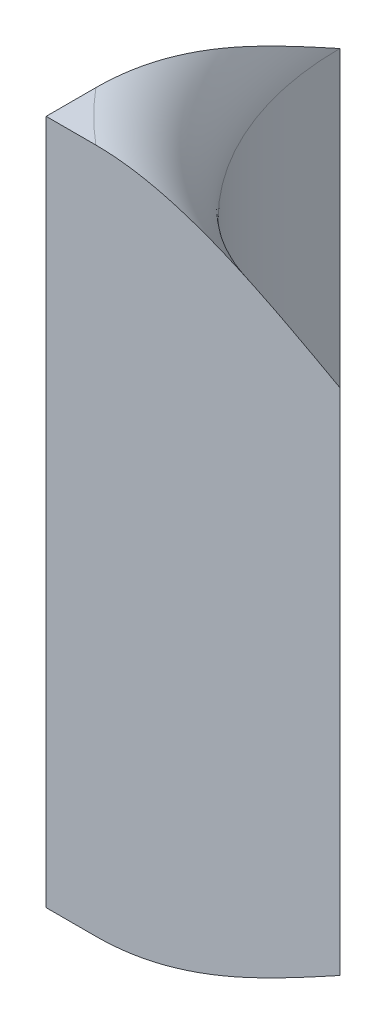
ISO-10303-21;
HEADER;
FILE_DESCRIPTION(('STEP AP214'),'2;1');
FILE_NAME('part.step','',(''),(''),'','','');
FILE_SCHEMA(('AUTOMOTIVE_DESIGN { 1 0 10303 214 1 1 1 1 }'));
ENDSEC;
DATA;
#1=APPLICATION_CONTEXT('core data for automotive mechanical design processes');
#2=APPLICATION_PROTOCOL_DEFINITION('international standard','automotive_design',2000,#1);
#3=PRODUCT_CONTEXT('',#1,'mechanical');
#4=PRODUCT('Part','Part','',(#3));
#5=PRODUCT_RELATED_PRODUCT_CATEGORY('part','',(#4));
#6=PRODUCT_DEFINITION_FORMATION('','',#4);
#7=PRODUCT_DEFINITION_CONTEXT('part definition',#1,'design');
#8=PRODUCT_DEFINITION('design','',#6,#7);
#9=PRODUCT_DEFINITION_SHAPE('','',#8);
#10=(LENGTH_UNIT() NAMED_UNIT(*) SI_UNIT(.MILLI.,.METRE.));
#11=(NAMED_UNIT(*) PLANE_ANGLE_UNIT() SI_UNIT($,.RADIAN.));
#12=(NAMED_UNIT(*) SI_UNIT($,.STERADIAN.) SOLID_ANGLE_UNIT());
#13=UNCERTAINTY_MEASURE_WITH_UNIT(LENGTH_MEASURE(1.E-05),#10,'distance_accuracy_value','');
#14=(GEOMETRIC_REPRESENTATION_CONTEXT(3) GLOBAL_UNCERTAINTY_ASSIGNED_CONTEXT((#13)) GLOBAL_UNIT_ASSIGNED_CONTEXT((#10,
#11,#12)) REPRESENTATION_CONTEXT('',''));
#15=CARTESIAN_POINT('',(0.,0.,0.));
#16=DIRECTION('',(0.,0.,1.));
#17=DIRECTION('',(1.,0.,0.));
#18=AXIS2_PLACEMENT_3D('',#15,#16,#17);
#19=CARTESIAN_POINT('',(4.3,1.06,-7.3));
#20=DIRECTION('',(0.,1.,0.));
#21=DIRECTION('',(0.,0.,1.));
#22=AXIS2_PLACEMENT_3D('',#19,#20,#21);
#23=TOROIDAL_SURFACE('',#22,0.389999999999999,0.09);
#24=CARTESIAN_POINT('',(4.,1.15,-7.05080128411138));
#25=CARTESIAN_POINT('',(4.,1.14996873881584,-7.06539050320358));
#26=CARTESIAN_POINT('',(4.,1.14856309488378,-7.07987147393059));
#27=CARTESIAN_POINT('',(4.,1.14368423695863,-7.10829216976645));
#28=CARTESIAN_POINT('',(4.,1.14023956259986,-7.12223658857574));
#29=CARTESIAN_POINT('',(4.,1.12752219042688,-7.16420253695043));
#30=CARTESIAN_POINT('',(4.,1.115942208103,-7.19147802039733));
#31=CARTESIAN_POINT('',(4.,1.09015615109007,-7.24483565452281));
#32=CARTESIAN_POINT('',(4.,1.07593214013188,-7.27090803790901));
#33=CARTESIAN_POINT('',(4.,1.06110939531161,-7.29797451018032));
#34=CARTESIAN_POINT('',(4.,1.06055469450968,-7.29898724918841));
#35=CARTESIAN_POINT('',(4.,1.06,-7.3));
#36=B_SPLINE_CURVE_WITH_KNOTS('',3,(#24,#25,#26,#27,#28,#29,#30,#31,#32,#33,#34,#35),
.UNSPECIFIED.,.F.,.F.,(4,2,2,2,2,4),(0.,0.0435527295939674,0.0865098187320563,0.175000963365773,
0.264115894109957,0.267579995726729),.UNSPECIFIED.);
#37=CARTESIAN_POINT('',(4.,1.15,-7.05080128411192));
#38=VERTEX_POINT('',#37);
#39=CARTESIAN_POINT('',(4.,1.06,-7.3));
#40=VERTEX_POINT('',#39);
#41=EDGE_CURVE('E67',#38,#40,#36,.T.);
#42=ORIENTED_EDGE('',*,*,#41,.F.);
#43=CARTESIAN_POINT('',(4.3,1.15,-7.3));
#44=DIRECTION('',(0.,1.,0.));
#45=DIRECTION('',(0.,0.,1.));
#46=AXIS2_PLACEMENT_3D('',#43,#44,#45);
#47=CIRCLE('',#46,0.39);
#48=CARTESIAN_POINT('',(4.05080128411123,1.15,-7.));
#49=VERTEX_POINT('',#48);
#50=EDGE_CURVE('E21',#49,#38,#47,.F.);
#51=ORIENTED_EDGE('',*,*,#50,.F.);
#52=CARTESIAN_POINT('',(4.3,1.06,-7.));
#53=CARTESIAN_POINT('',(4.29898725661568,1.0605546933115,-7.));
#54=CARTESIAN_POINT('',(4.29797451732509,1.06110939416549,-7.));
#55=CARTESIAN_POINT('',(4.27049202919066,1.07615989168967,-6.99999999999999));
#56=CARTESIAN_POINT('',(4.2439983479499,1.09061098047868,-7.));
#57=CARTESIAN_POINT('',(4.18967717491193,1.11675946724623,-7.));
#58=CARTESIAN_POINT('',(4.16185568411187,1.12846806008294,-7.));
#59=CARTESIAN_POINT('',(4.11373742133393,1.1426386060633,-7.));
#60=CARTESIAN_POINT('',(4.0940272781199,1.14688228554531,-7.));
#61=CARTESIAN_POINT('',(4.06402445895713,1.14981614838478,-7.));
#62=CARTESIAN_POINT('',(4.05390597518062,1.15021635400833,-7.));
#63=CARTESIAN_POINT('',(4.03370986034958,1.1495579808952,-7.));
#64=CARTESIAN_POINT('',(4.02363219071495,1.14850159887963,-7.));
#65=CARTESIAN_POINT('',(4.00684979518928,1.14519918623927,-7.));
#66=CARTESIAN_POINT('',(4.0000549415783,1.14341502426509,-7.));
#67=CARTESIAN_POINT('',(3.98679600381803,1.13886646101216,-7.));
#68=CARTESIAN_POINT('',(3.98033161813731,1.13610297225816,-7.));
#69=CARTESIAN_POINT('',(3.9691456758505,1.13012138519625,-7.));
#70=CARTESIAN_POINT('',(3.96432582286341,1.12708831558089,-7.));
#71=CARTESIAN_POINT('',(3.95523875596396,1.12028079794344,-7.));
#72=CARTESIAN_POINT('',(3.95097085040485,1.11650729299448,-7.));
#73=CARTESIAN_POINT('',(3.94395259376659,1.10903441492666,-7.));
#74=CARTESIAN_POINT('',(3.94106831875637,1.10546117484759,-7.));
#75=CARTESIAN_POINT('',(3.93592638908621,1.09788615695022,-7.));
#76=CARTESIAN_POINT('',(3.93366846791901,1.09388456239997,-7.));
#77=CARTESIAN_POINT('',(3.92989142890799,1.08551161903109,-7.));
#78=CARTESIAN_POINT('',(3.928377215587,1.08113803302173,-7.));
#79=CARTESIAN_POINT('',(3.92621203743497,1.07218112849729,-7.));
#80=CARTESIAN_POINT('',(3.92556065799353,1.06759791181044,-7.));
#81=CARTESIAN_POINT('',(3.92518958858274,1.05891376678059,-7.));
#82=CARTESIAN_POINT('',(3.92537314245993,1.05481671703713,-7.));
#83=CARTESIAN_POINT('',(3.9264439157805,1.04671856100796,-7.));
#84=CARTESIAN_POINT('',(3.92733068805597,1.04271739541586,-7.));
#85=CARTESIAN_POINT('',(3.92972859349771,1.03501262320044,-7.));
#86=CARTESIAN_POINT('',(3.93122452010426,1.03130422631035,-7.));
#87=CARTESIAN_POINT('',(3.93476988704399,1.02415641295071,-7.));
#88=CARTESIAN_POINT('',(3.9368202788027,1.02071747205479,-7.));
#89=CARTESIAN_POINT('',(3.94160127423581,1.0138664688397,-7.));
#90=CARTESIAN_POINT('',(3.9443772931541,1.01048640398363,-7.));
#91=CARTESIAN_POINT('',(3.950367674953,1.00416465676449,-7.));
#92=CARTESIAN_POINT('',(3.95358018002081,1.00122122144442,-7.));
#93=CARTESIAN_POINT('',(3.95696253280322,0.998504073935786,-7.));
#94=B_SPLINE_CURVE_WITH_KNOTS('',3,(#52,#53,#54,#55,#56,#57,#58,#59,#60,#61,#62,#63,#64,#65,#66,
#67,#68,#69,#70,#71,#72,#73,#74,#75,#76,#77,#78,#79,#80,#81,#82,#83,#84,#85,#86,#87,#88,#89,#90,
#91,#92,#93),.UNSPECIFIED.,.F.,.F.,(4,2,2,2,2,2,2,2,2,2,2,2,2,2,2,2,2,2,2,2,4),(0.,
0.0034641016160863,0.094001323141591,0.184162267737905,0.244240211028,0.274541767257793,
0.304797674801016,0.325813063735681,0.346808922053318,0.363831063314085,0.380831663025118,
0.39455260831554,0.408267706495766,0.422072076080107,0.435869809956176,0.448112045060005,
0.460346501713532,0.472292633881982,0.48425939634465,0.497334648987111,0.510355897946333),.UNSPECIFIED.);
#95=CARTESIAN_POINT('',(4.29999999999999,1.06,-7.));
#96=VERTEX_POINT('',#95);
#97=EDGE_CURVE('E64',#96,#49,#94,.T.);
#98=ORIENTED_EDGE('',*,*,#97,.F.);
#99=CARTESIAN_POINT('',(4.3,1.06,-7.3));
#100=DIRECTION('',(0.,1.,0.));
#101=DIRECTION('',(0.,0.,1.));
#102=AXIS2_PLACEMENT_3D('',#99,#100,#101);
#103=CIRCLE('',#102,0.3);
#104=EDGE_CURVE('E71',#40,#96,#103,.T.);
#105=ORIENTED_EDGE('',*,*,#104,.F.);
#106=EDGE_LOOP('',(#42,#51,#98,#105));
#107=FACE_BOUND('',#106,.T.);
#108=ADVANCED_FACE('F17',(#107),#23,.T.);
#109=CARTESIAN_POINT('',(3.999,1.15,-7.051801284111));
#110=DIRECTION('',(0.,1.,0.));
#111=DIRECTION('',(0.,0.,1.));
#112=AXIS2_PLACEMENT_3D('',#109,#110,#111);
#113=PLANE('',#112);
#114=DIRECTION('',(-1.,0.,0.));
#115=VECTOR('',#114,1.);
#116=CARTESIAN_POINT('',(4.15,1.15,-7.));
#117=LINE('',#116,#115);
#118=CARTESIAN_POINT('',(4.,1.15,-7.));
#119=VERTEX_POINT('',#118);
#120=EDGE_CURVE('E73',#49,#119,#117,.T.);
#121=ORIENTED_EDGE('',*,*,#120,.F.);
#122=ORIENTED_EDGE('',*,*,#50,.T.);
#123=DIRECTION('',(0.,0.,-1.));
#124=VECTOR('',#123,1.);
#125=CARTESIAN_POINT('',(4.,1.15,-7.15));
#126=LINE('',#125,#124);
#127=EDGE_CURVE('E75',#119,#38,#126,.T.);
#128=ORIENTED_EDGE('',*,*,#127,.F.);
#129=EDGE_LOOP('',(#121,#122,#128));
#130=FACE_BOUND('',#129,.T.);
#131=ADVANCED_FACE('F74',(#130),#113,.T.);
#132=CARTESIAN_POINT('',(4.3,1.06,-7.3));
#133=DIRECTION('',(0.,-1.,0.));
#134=DIRECTION('',(0.,0.,-1.));
#135=AXIS2_PLACEMENT_3D('',#132,#133,#134);
#136=CYLINDRICAL_SURFACE('',#135,0.3);
#137=CARTESIAN_POINT('',(4.3,0.54,-7.3));
#138=DIRECTION('',(0.,1.,0.));
#139=DIRECTION('',(0.,0.,1.));
#140=AXIS2_PLACEMENT_3D('',#137,#138,#139);
#141=CIRCLE('',#140,0.299999999999999);
#142=CARTESIAN_POINT('',(4.,0.54,-7.3));
#143=VERTEX_POINT('',#142);
#144=CARTESIAN_POINT('',(4.3,0.54,-7.));
#145=VERTEX_POINT('',#144);
#146=EDGE_CURVE('E122',#143,#145,#141,.T.);
#147=ORIENTED_EDGE('',*,*,#146,.F.);
#148=DIRECTION('',(0.,-1.,0.));
#149=VECTOR('',#148,1.);
#150=CARTESIAN_POINT('',(4.,0.800000000000238,-7.3));
#151=LINE('',#150,#149);
#152=EDGE_CURVE('E82',#40,#143,#151,.T.);
#153=ORIENTED_EDGE('',*,*,#152,.F.);
#154=ORIENTED_EDGE('',*,*,#104,.T.);
#155=DIRECTION('',(0.,1.,0.));
#156=VECTOR('',#155,1.);
#157=CARTESIAN_POINT('',(4.3,0.799999999999761,-7.));
#158=LINE('',#157,#156);
#159=EDGE_CURVE('E78',#145,#96,#158,.T.);
#160=ORIENTED_EDGE('',*,*,#159,.F.);
#161=EDGE_LOOP('',(#147,#153,#154,#160));
#162=FACE_BOUND('',#161,.T.);
#163=ADVANCED_FACE('F102',(#162),#136,.F.);
#164=CARTESIAN_POINT('',(3.999,1.15100000000047,-7.));
#165=DIRECTION('',(0.,0.,1.));
#166=DIRECTION('',(0.,-1.,0.));
#167=AXIS2_PLACEMENT_3D('',#164,#165,#166);
#168=PLANE('',#167);
#169=ORIENTED_EDGE('',*,*,#159,.T.);
#170=ORIENTED_EDGE('',*,*,#97,.T.);
#171=ORIENTED_EDGE('',*,*,#120,.T.);
#172=DIRECTION('',(0.,1.,0.));
#173=VECTOR('',#172,1.);
#174=CARTESIAN_POINT('',(4.,0.800000000000238,-7.));
#175=LINE('',#174,#173);
#176=CARTESIAN_POINT('',(4.,0.45,-7.));
#177=VERTEX_POINT('',#176);
#178=EDGE_CURVE('E133',#177,#119,#175,.T.);
#179=ORIENTED_EDGE('',*,*,#178,.F.);
#180=DIRECTION('',(-1.,0.,0.));
#181=VECTOR('',#180,1.);
#182=CARTESIAN_POINT('',(4.0254006420555,0.45,-7.));
#183=LINE('',#182,#181);
#184=CARTESIAN_POINT('',(4.05080128411123,0.45,-7.));
#185=VERTEX_POINT('',#184);
#186=EDGE_CURVE('E120',#185,#177,#183,.T.);
#187=ORIENTED_EDGE('',*,*,#186,.F.);
#188=CARTESIAN_POINT('',(4.05080128411138,0.45,-7.));
#189=CARTESIAN_POINT('',(4.06539050320358,0.45003126118416,-7.));
#190=CARTESIAN_POINT('',(4.07987147393059,0.451436905116225,-7.));
#191=CARTESIAN_POINT('',(4.10829216976645,0.456315763041371,-7.));
#192=CARTESIAN_POINT('',(4.12223658857575,0.459760437400146,-7.));
#193=CARTESIAN_POINT('',(4.16420253695043,0.472477809573121,-7.));
#194=CARTESIAN_POINT('',(4.19147802039734,0.484057791896987,-7.));
#195=CARTESIAN_POINT('',(4.2448356545228,0.509843848909943,-7.));
#196=CARTESIAN_POINT('',(4.27090803790898,0.524067859868177,-7.));
#197=CARTESIAN_POINT('',(4.29797451018031,0.53889060468839,-7.));
#198=CARTESIAN_POINT('',(4.29898724918841,0.539445305490318,-7.));
#199=CARTESIAN_POINT('',(4.3,0.54,-7.));
#200=B_SPLINE_CURVE_WITH_KNOTS('',3,(#188,#189,#190,#191,#192,#193,#194,#195,#196,#197,#198,
#199),.UNSPECIFIED.,.F.,.F.,(4,2,2,2,2,4),(0.,0.0435527295939736,0.0865098187320572,
0.175000963365769,0.264115894109955,0.267579995726728),.UNSPECIFIED.);
#201=EDGE_CURVE('E132',#145,#185,#200,.F.);
#202=ORIENTED_EDGE('',*,*,#201,.F.);
#203=EDGE_LOOP('',(#169,#170,#171,#179,#187,#202));
#204=FACE_BOUND('',#203,.T.);
#205=ADVANCED_FACE('F80',(#204),#168,.T.);
#206=CARTESIAN_POINT('',(4.,0.448999999999526,-6.999));
#207=DIRECTION('',(-1.,0.,0.));
#208=DIRECTION('',(0.,1.,0.));
#209=AXIS2_PLACEMENT_3D('',#206,#207,#208);
#210=PLANE('',#209);
#211=ORIENTED_EDGE('',*,*,#178,.T.);
#212=ORIENTED_EDGE('',*,*,#127,.T.);
#213=ORIENTED_EDGE('',*,*,#41,.T.);
#214=ORIENTED_EDGE('',*,*,#152,.T.);
#215=CARTESIAN_POINT('',(4.,0.45,-7.05080128411138));
#216=CARTESIAN_POINT('',(4.,0.450031261184152,-7.0653905032036));
#217=CARTESIAN_POINT('',(4.,0.451436905116223,-7.07987147393061));
#218=CARTESIAN_POINT('',(4.,0.45631576304138,-7.10829216976647));
#219=CARTESIAN_POINT('',(4.,0.459760437400156,-7.12223658857575));
#220=CARTESIAN_POINT('',(4.,0.472477809573104,-7.16420253695043));
#221=CARTESIAN_POINT('',(4.,0.484057791896904,-7.19147802039737));
#222=CARTESIAN_POINT('',(4.,0.509843848910017,-7.24483565452275));
#223=CARTESIAN_POINT('',(4.,0.524067859868477,-7.27090803790881));
#224=CARTESIAN_POINT('',(4.,0.538890604688413,-7.2979745101803));
#225=CARTESIAN_POINT('',(4.,0.53944530549033,-7.2989872491884));
#226=CARTESIAN_POINT('',(4.,0.54,-7.3));
#227=B_SPLINE_CURVE_WITH_KNOTS('',3,(#215,#216,#217,#218,#219,#220,#221,#222,#223,#224,#225,
#226),.UNSPECIFIED.,.F.,.F.,(4,2,2,2,2,4),(0.,0.0435527295940043,0.0865098187320554,
0.17500096336575,0.264115894109954,0.267579995726728),.UNSPECIFIED.);
#228=CARTESIAN_POINT('',(4.,0.45,-7.05080128411192));
#229=VERTEX_POINT('',#228);
#230=EDGE_CURVE('E36',#229,#143,#227,.T.);
#231=ORIENTED_EDGE('',*,*,#230,.F.);
#232=DIRECTION('',(0.,0.,-1.));
#233=VECTOR('',#232,1.);
#234=CARTESIAN_POINT('',(4.,0.45,-7.0254006420555));
#235=LINE('',#234,#233);
#236=EDGE_CURVE('E27',#177,#229,#235,.T.);
#237=ORIENTED_EDGE('',*,*,#236,.F.);
#238=EDGE_LOOP('',(#211,#212,#213,#214,#231,#237));
#239=FACE_BOUND('',#238,.T.);
#240=ADVANCED_FACE('F109',(#239),#210,.T.);
#241=CARTESIAN_POINT('',(4.3,0.54,-7.3));
#242=DIRECTION('',(0.,-1.,0.));
#243=DIRECTION('',(0.,0.,-1.));
#244=AXIS2_PLACEMENT_3D('',#241,#242,#243);
#245=TOROIDAL_SURFACE('',#244,0.39,0.0899999999999999);
#246=ORIENTED_EDGE('',*,*,#230,.T.);
#247=ORIENTED_EDGE('',*,*,#146,.T.);
#248=ORIENTED_EDGE('',*,*,#201,.T.);
#249=CARTESIAN_POINT('',(4.3,0.45,-7.3));
#250=DIRECTION('',(0.,-1.,0.));
#251=DIRECTION('',(0.,0.,-1.));
#252=AXIS2_PLACEMENT_3D('',#249,#250,#251);
#253=CIRCLE('',#252,0.39);
#254=EDGE_CURVE('E11',#229,#185,#253,.F.);
#255=ORIENTED_EDGE('',*,*,#254,.F.);
#256=EDGE_LOOP('',(#246,#247,#248,#255));
#257=FACE_BOUND('',#256,.T.);
#258=ADVANCED_FACE('F112',(#257),#245,.T.);
#259=CARTESIAN_POINT('',(3.999,0.45,-6.999));
#260=DIRECTION('',(0.,-1.,0.));
#261=DIRECTION('',(0.,0.,-1.));
#262=AXIS2_PLACEMENT_3D('',#259,#260,#261);
#263=PLANE('',#262);
#264=ORIENTED_EDGE('',*,*,#236,.T.);
#265=ORIENTED_EDGE('',*,*,#254,.T.);
#266=ORIENTED_EDGE('',*,*,#186,.T.);
#267=EDGE_LOOP('',(#264,#265,#266));
#268=FACE_BOUND('',#267,.T.);
#269=ADVANCED_FACE('F19',(#268),#263,.T.);
#270=CLOSED_SHELL('',(#108,#131,#163,#205,#240,#258,#269));
#271=MANIFOLD_SOLID_BREP('B1',#270);
#272=ADVANCED_BREP_SHAPE_REPRESENTATION('',(#18,#271),#14);
#273=SHAPE_DEFINITION_REPRESENTATION(#9,#272);
ENDSEC;
END-ISO-10303-21;
